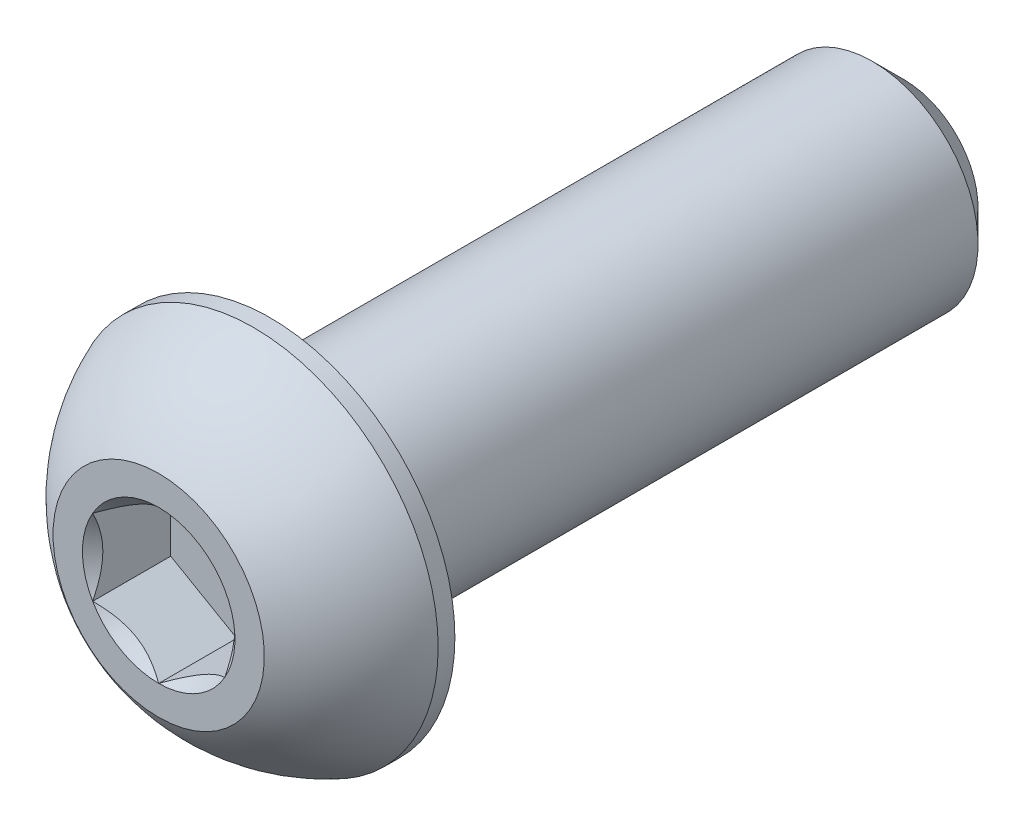
ISO-10303-21;
HEADER;
FILE_DESCRIPTION(('STEP AP214'),'2;1');
FILE_NAME('part.step','',(''),(''),'','','');
FILE_SCHEMA(('AUTOMOTIVE_DESIGN { 1 0 10303 214 1 1 1 1 }'));
ENDSEC;
DATA;
#1=APPLICATION_CONTEXT('core data for automotive mechanical design processes');
#2=APPLICATION_PROTOCOL_DEFINITION('international standard','automotive_design',2000,#1);
#3=PRODUCT_CONTEXT('',#1,'mechanical');
#4=PRODUCT('Part','Part','',(#3));
#5=PRODUCT_RELATED_PRODUCT_CATEGORY('part','',(#4));
#6=PRODUCT_DEFINITION_FORMATION('','',#4);
#7=PRODUCT_DEFINITION_CONTEXT('part definition',#1,'design');
#8=PRODUCT_DEFINITION('design','',#6,#7);
#9=PRODUCT_DEFINITION_SHAPE('','',#8);
#10=(LENGTH_UNIT() NAMED_UNIT(*) SI_UNIT(.MILLI.,.METRE.));
#11=(NAMED_UNIT(*) PLANE_ANGLE_UNIT() SI_UNIT($,.RADIAN.));
#12=(NAMED_UNIT(*) SI_UNIT($,.STERADIAN.) SOLID_ANGLE_UNIT());
#13=UNCERTAINTY_MEASURE_WITH_UNIT(LENGTH_MEASURE(1.E-05),#10,'distance_accuracy_value','');
#14=(GEOMETRIC_REPRESENTATION_CONTEXT(3) GLOBAL_UNCERTAINTY_ASSIGNED_CONTEXT((#13)) GLOBAL_UNIT_ASSIGNED_CONTEXT((#10,
#11,#12)) REPRESENTATION_CONTEXT('',''));
#15=CARTESIAN_POINT('',(0.,0.,0.));
#16=DIRECTION('',(0.,0.,1.));
#17=DIRECTION('',(1.,0.,0.));
#18=AXIS2_PLACEMENT_3D('',#15,#16,#17);
#19=CARTESIAN_POINT('',(0.,-3.175,-22.4028));
#20=DIRECTION('',(0.,0.,-1.));
#21=DIRECTION('',(0.,1.,0.));
#22=AXIS2_PLACEMENT_3D('',#19,#20,#21);
#23=PLANE('',#22);
#24=CARTESIAN_POINT('',(0.,0.,-22.4028));
#25=DIRECTION('',(0.,0.,-1.));
#26=DIRECTION('',(0.,1.,0.));
#27=AXIS2_PLACEMENT_3D('',#24,#25,#26);
#28=CIRCLE('',#27,2.22250000000001);
#29=CARTESIAN_POINT('',(0.,2.22250000000001,-22.4028));
#30=VERTEX_POINT('',#29);
#31=EDGE_CURVE('E178',#30,#30,#28,.T.);
#32=ORIENTED_EDGE('',*,*,#31,.T.);
#33=EDGE_LOOP('',(#32));
#34=FACE_BOUND('',#33,.T.);
#35=ADVANCED_FACE('F38',(#34),#23,.T.);
#36=CARTESIAN_POINT('',(0.,0.,-22.4028));
#37=DIRECTION('',(0.,0.,-1.));
#38=DIRECTION('',(0.,1.,0.));
#39=AXIS2_PLACEMENT_3D('',#36,#37,#38);
#40=CYLINDRICAL_SURFACE('',#39,3.175);
#41=CARTESIAN_POINT('',(0.,0.,-21.4503));
#42=DIRECTION('',(0.,0.,-1.));
#43=DIRECTION('',(0.,1.,0.));
#44=AXIS2_PLACEMENT_3D('',#41,#42,#43);
#45=CIRCLE('',#44,3.175);
#46=CARTESIAN_POINT('',(0.,3.175,-21.4503));
#47=VERTEX_POINT('',#46);
#48=EDGE_CURVE('E52',#47,#47,#45,.F.);
#49=ORIENTED_EDGE('',*,*,#48,.T.);
#50=EDGE_LOOP('',(#49));
#51=FACE_BOUND('',#50,.T.);
#52=CARTESIAN_POINT('',(0.,0.,-3.3528));
#53=DIRECTION('',(0.,0.,1.));
#54=DIRECTION('',(1.,0.,0.));
#55=AXIS2_PLACEMENT_3D('',#52,#53,#54);
#56=CIRCLE('',#55,3.175);
#57=CARTESIAN_POINT('',(3.175,0.,-3.3528));
#58=VERTEX_POINT('',#57);
#59=EDGE_CURVE('E175',#58,#58,#56,.F.);
#60=ORIENTED_EDGE('',*,*,#59,.T.);
#61=EDGE_LOOP('',(#60));
#62=FACE_BOUND('',#61,.T.);
#63=ADVANCED_FACE('F183',(#51,#62),#40,.T.);
#64=CARTESIAN_POINT('',(0.,0.,-22.4028));
#65=DIRECTION('',(0.,0.,1.));
#66=DIRECTION('',(0.,-1.,0.));
#67=AXIS2_PLACEMENT_3D('',#64,#65,#66);
#68=CONICAL_SURFACE('',#67,2.22250000000001,0.785398163397448);
#69=ORIENTED_EDGE('',*,*,#48,.F.);
#70=EDGE_LOOP('',(#69));
#71=FACE_BOUND('',#70,.T.);
#72=ORIENTED_EDGE('',*,*,#31,.F.);
#73=EDGE_LOOP('',(#72));
#74=FACE_BOUND('',#73,.T.);
#75=ADVANCED_FACE('F40',(#71,#74),#68,.T.);
#76=CARTESIAN_POINT('',(0.,0.,-5.060315));
#77=DIRECTION('',(0.,0.,1.));
#78=DIRECTION('',(0.,-1.,0.));
#79=AXIS2_PLACEMENT_3D('',#76,#77,#78);
#80=SPHERICAL_SURFACE('',#79,5.97389428256184);
#81=CARTESIAN_POINT('',(0.,0.,0.));
#82=DIRECTION('',(0.,0.,1.));
#83=DIRECTION('',(1.,0.,0.));
#84=AXIS2_PLACEMENT_3D('',#81,#82,#83);
#85=CIRCLE('',#84,3.175);
#86=CARTESIAN_POINT('',(0.,-3.175,0.));
#87=VERTEX_POINT('',#86);
#88=EDGE_CURVE('E172',#87,#87,#85,.T.);
#89=CARTESIAN_POINT('',(0.,0.,-2.84988));
#90=DIRECTION('',(0.,0.,1.));
#91=DIRECTION('',(1.,0.,0.));
#92=AXIS2_PLACEMENT_3D('',#89,#90,#91);
#93=CIRCLE('',#92,5.5499);
#94=CARTESIAN_POINT('',(0.,-5.5499,-2.84988));
#95=VERTEX_POINT('',#94);
#96=EDGE_CURVE('E166',#95,#95,#93,.T.);
#97=CARTESIAN_POINT('',(0.,-3.175,0.));
#98=CARTESIAN_POINT('',(0.,-3.20828343957184,-0.0208830076580502));
#99=CARTESIAN_POINT('',(0.,-3.24136078860705,-0.0420944789280503));
#100=CARTESIAN_POINT('',(0.,-3.30709055775141,-0.0851658910984718));
#101=CARTESIAN_POINT('',(0.,-3.33974297786056,-0.107025831998893));
#102=CARTESIAN_POINT('',(0.,-3.40461014130008,-0.151385725836676));
#103=CARTESIAN_POINT('',(0.,-3.43682488463043,-0.173885678774039));
#104=CARTESIAN_POINT('',(0.,-3.50080416139461,-0.219516822259479));
#105=CARTESIAN_POINT('',(0.,-3.53256869482844,-0.242648012807557));
#106=CARTESIAN_POINT('',(0.,-3.59563518208834,-0.289532629449102));
#107=CARTESIAN_POINT('',(0.,-3.62693713591442,-0.313286055542569));
#108=CARTESIAN_POINT('',(0.,-3.68906627753106,-0.36140589409133));
#109=CARTESIAN_POINT('',(0.,-3.71989346532163,-0.385772306546626));
#110=CARTESIAN_POINT('',(0.,-3.78106107243204,-0.435108631276877));
#111=CARTESIAN_POINT('',(0.,-3.8114014917519,-0.460078543551833));
#112=CARTESIAN_POINT('',(0.,-3.87158374923259,-0.510612146063938));
#113=CARTESIAN_POINT('',(0.,-3.90142558739343,-0.536175836301086));
#114=CARTESIAN_POINT('',(0.,-3.96059906392414,-0.587887041792083));
#115=CARTESIAN_POINT('',(0.,-3.989930702294,-0.614034557045931));
#116=CARTESIAN_POINT('',(0.,-4.04807235926832,-0.666903232293407));
#117=CARTESIAN_POINT('',(0.,-4.07688237787279,-0.693624392287034));
#118=CARTESIAN_POINT('',(0.,-4.13396957842491,-0.747629953401057));
#119=CARTESIAN_POINT('',(0.,-4.16224676037257,-0.774914354521453));
#120=CARTESIAN_POINT('',(0.,-4.21825727817542,-0.830035774981947));
#121=CARTESIAN_POINT('',(0.,-4.24599061403061,-0.857872794322045));
#122=CARTESIAN_POINT('',(0.,-4.30090264195357,-0.91408861315902));
#123=CARTESIAN_POINT('',(0.,-4.32808133402134,-0.942467412655899));
#124=CARTESIAN_POINT('',(0.,-4.38187349261953,-0.999755742806741));
#125=CARTESIAN_POINT('',(0.,-4.40848695914995,-1.0286652734607));
#126=CARTESIAN_POINT('',(0.,-4.46113830498838,-1.08700381029123));
#127=CARTESIAN_POINT('',(0.,-4.48717618429639,-1.11643281646778));
#128=CARTESIAN_POINT('',(0.,-4.53866621810402,-1.17579884645643));
#129=CARTESIAN_POINT('',(0.,-4.56411837260364,-1.20573587026853));
#130=CARTESIAN_POINT('',(0.,-4.61442704725457,-1.26610627984964));
#131=CARTESIAN_POINT('',(0.,-4.63928356740587,-1.29653966561866));
#132=CARTESIAN_POINT('',(0.,-4.68839129572448,-1.3578909501815));
#133=CARTESIAN_POINT('',(0.,-4.71264250389178,-1.38880884897531));
#134=CARTESIAN_POINT('',(0.,-4.76053016627881,-1.45111712201534));
#135=CARTESIAN_POINT('',(0.,-4.78416662049853,-1.48250749626155));
#136=CARTESIAN_POINT('',(0.,-4.8308155723751,-1.54574849868041));
#137=CARTESIAN_POINT('',(0.,-4.85382807003194,-1.57759912685306));
#138=CARTESIAN_POINT('',(0.,-4.89922014909859,-1.64174823640362));
#139=CARTESIAN_POINT('',(0.,-4.92159973050841,-1.67404671778154));
#140=CARTESIAN_POINT('',(0.,-4.96571726381658,-1.73907895865427));
#141=CARTESIAN_POINT('',(0.,-4.98745521571493,-1.77181271814908));
#142=CARTESIAN_POINT('',(0.,-5.03028102654719,-1.83770277069632));
#143=CARTESIAN_POINT('',(0.,-5.0513688854811,-1.87085906374874));
#144=CARTESIAN_POINT('',(0.,-5.09288630004063,-1.93758127434189));
#145=CARTESIAN_POINT('',(0.,-5.11331585566624,-1.97114719188261));
#146=CARTESIAN_POINT('',(0.,-5.15350870956168,-2.03867558290299));
#147=CARTESIAN_POINT('',(0.,-5.17327200783151,-2.07263805638265));
#148=CARTESIAN_POINT('',(0.,-5.21212465239608,-2.14094633632486));
#149=CARTESIAN_POINT('',(0.,-5.23121399869082,-2.17529214278741));
#150=CARTESIAN_POINT('',(0.,-5.26871130697935,-2.2443537165359));
#151=CARTESIAN_POINT('',(0.,-5.28711926897315,-2.27906948382184));
#152=CARTESIAN_POINT('',(0.,-5.32324664200827,-2.3488574628552));
#153=CARTESIAN_POINT('',(0.,-5.3409660530496,-2.38392967460262));
#154=CARTESIAN_POINT('',(0.,-5.37570942417474,-2.45441688802313));
#155=CARTESIAN_POINT('',(0.,-5.39273338425856,-2.48983188969622));
#156=CARTESIAN_POINT('',(0.,-5.42607922958184,-2.56099089271574));
#157=CARTESIAN_POINT('',(0.,-5.44240111482132,-2.59673489406217));
#158=CARTESIAN_POINT('',(0.,-5.47433643994316,-2.66853798649801));
#159=CARTESIAN_POINT('',(0.,-5.48994987982553,-2.70459707758742));
#160=CARTESIAN_POINT('',(0.,-5.52046229408188,-2.77701628549785));
#161=CARTESIAN_POINT('',(0.,-5.53536126845586,-2.81337640231887));
#162=CARTESIAN_POINT('',(0.,-5.5499,-2.84988));
#163=B_SPLINE_CURVE_WITH_KNOTS('',3,(#97,#98,#99,#100,#101,#102,#103,#104,#105,#106,#107,#108,
#109,#110,#111,#112,#113,#114,#115,#116,#117,#118,#119,#120,#121,#122,#123,#124,#125,#126,#127,
#128,#129,#130,#131,#132,#133,#134,#135,#136,#137,#138,#139,#140,#141,#142,#143,#144,#145,#146,
#147,#148,#149,#150,#151,#152,#153,#154,#155,#156,#157,#158,#159,#160,#161,#162),.UNSPECIFIED.,
.F.,.F.,(4,2,2,2,2,2,2,2,2,2,2,2,2,2,2,2,2,2,2,2,2,2,2,2,2,2,2,2,2,2,2,2,4),(0.,0.1178750807537,
0.235750161507399,0.353625242261099,0.471500323014798,0.589375403768498,0.707250484522198,
0.825125565275897,0.943000646029597,1.0608757267833,1.17875080753699,1.2966258882907,
1.41450096904439,1.53237604979809,1.65025113055179,1.76812621130549,1.88600129205919,
2.00387637281289,2.12175145356659,2.23962653432029,2.35750161507399,2.47537669582769,
2.59325177658139,2.71112685733509,2.82900193808879,2.94687701884249,3.06475209959619,
3.18262718034989,3.30050226110359,3.41837734185729,3.53625242261099,3.65412750336469,
3.77200258411839),.UNSPECIFIED.);
#164=EDGE_CURVE('BSEAM188',#87,#95,#163,.T.);
#165=ORIENTED_EDGE('',*,*,#88,.F.);
#166=ORIENTED_EDGE('',*,*,#96,.T.);
#167=ORIENTED_EDGE('',*,*,#164,.T.);
#168=ORIENTED_EDGE('',*,*,#164,.F.);
#169=EDGE_LOOP('',(#165,#167,#166,#168));
#170=FACE_BOUND('',#169,.T.);
#171=ADVANCED_FACE('F188',(#170),#80,.T.);
#172=CARTESIAN_POINT('',(0.,-3.175,0.));
#173=DIRECTION('',(0.,0.,-1.));
#174=DIRECTION('',(-1.,0.,0.));
#175=AXIS2_PLACEMENT_3D('',#172,#173,#174);
#176=PLANE('',#175);
#177=CARTESIAN_POINT('',(0.,0.,0.));
#178=DIRECTION('',(0.,0.,1.));
#179=DIRECTION('',(1.,0.,0.));
#180=AXIS2_PLACEMENT_3D('',#177,#178,#179);
#181=CIRCLE('',#180,2.29135888084633);
#182=CARTESIAN_POINT('',(-1.984375,1.14567944042316,0.));
#183=VERTEX_POINT('',#182);
#184=CARTESIAN_POINT('',(-1.984375,-1.14567944042316,0.));
#185=VERTEX_POINT('',#184);
#186=EDGE_CURVE('E65',#183,#185,#181,.T.);
#187=ORIENTED_EDGE('',*,*,#186,.F.);
#188=CARTESIAN_POINT('',(0.,2.29135888084633,0.));
#189=VERTEX_POINT('',#188);
#190=EDGE_CURVE('E137',#189,#183,#181,.T.);
#191=ORIENTED_EDGE('',*,*,#190,.F.);
#192=CARTESIAN_POINT('',(1.984375,1.14567944042316,0.));
#193=VERTEX_POINT('',#192);
#194=EDGE_CURVE('E134',#193,#189,#181,.T.);
#195=ORIENTED_EDGE('',*,*,#194,.F.);
#196=CARTESIAN_POINT('',(1.984375,-1.14567944042316,0.));
#197=VERTEX_POINT('',#196);
#198=EDGE_CURVE('E105',#197,#193,#181,.T.);
#199=ORIENTED_EDGE('',*,*,#198,.F.);
#200=CARTESIAN_POINT('',(0.,-2.29135888084633,0.));
#201=VERTEX_POINT('',#200);
#202=EDGE_CURVE('E97',#201,#197,#181,.T.);
#203=ORIENTED_EDGE('',*,*,#202,.F.);
#204=EDGE_CURVE('E58',#185,#201,#181,.T.);
#205=ORIENTED_EDGE('',*,*,#204,.F.);
#206=EDGE_LOOP('',(#187,#191,#195,#199,#203,#205));
#207=FACE_BOUND('',#206,.T.);
#208=ORIENTED_EDGE('',*,*,#88,.T.);
#209=EDGE_LOOP('',(#208));
#210=FACE_BOUND('',#209,.T.);
#211=ADVANCED_FACE('F131',(#207,#210),#176,.F.);
#212=CARTESIAN_POINT('',(0.,-5.5499,-3.3528));
#213=DIRECTION('',(0.,0.,1.));
#214=DIRECTION('',(1.,0.,0.));
#215=AXIS2_PLACEMENT_3D('',#212,#213,#214);
#216=PLANE('',#215);
#217=ORIENTED_EDGE('',*,*,#59,.F.);
#218=EDGE_LOOP('',(#217));
#219=FACE_BOUND('',#218,.T.);
#220=CARTESIAN_POINT('',(0.,0.,-3.3528));
#221=DIRECTION('',(0.,0.,1.));
#222=DIRECTION('',(1.,0.,0.));
#223=AXIS2_PLACEMENT_3D('',#220,#221,#222);
#224=CIRCLE('',#223,5.5499);
#225=CARTESIAN_POINT('',(5.5499,0.,-3.3528));
#226=VERTEX_POINT('',#225);
#227=EDGE_CURVE('E169',#226,#226,#224,.T.);
#228=ORIENTED_EDGE('',*,*,#227,.F.);
#229=EDGE_LOOP('',(#228));
#230=FACE_BOUND('',#229,.T.);
#231=ADVANCED_FACE('F202',(#219,#230),#216,.F.);
#232=CARTESIAN_POINT('',(0.,0.,0.));
#233=DIRECTION('',(0.,0.,1.));
#234=DIRECTION('',(1.,0.,0.));
#235=AXIS2_PLACEMENT_3D('',#232,#233,#234);
#236=CYLINDRICAL_SURFACE('',#235,5.5499);
#237=ORIENTED_EDGE('',*,*,#96,.F.);
#238=EDGE_LOOP('',(#237));
#239=FACE_BOUND('',#238,.T.);
#240=ORIENTED_EDGE('',*,*,#227,.T.);
#241=EDGE_LOOP('',(#240));
#242=FACE_BOUND('',#241,.T.);
#243=ADVANCED_FACE('F205',(#239,#242),#236,.T.);
#244=CARTESIAN_POINT('',(0.,0.,0.));
#245=DIRECTION('',(0.,0.,1.));
#246=DIRECTION('',(1.,0.,0.));
#247=AXIS2_PLACEMENT_3D('',#244,#245,#246);
#248=CONICAL_SURFACE('',#247,2.29135888084633,0.78539816339745);
#249=ORIENTED_EDGE('',*,*,#198,.T.);
#250=CARTESIAN_POINT('',(1.984375,-2.28495242157822,0.734984078816568));
#251=CARTESIAN_POINT('',(1.984375,-2.22931635455402,0.692986685550762));
#252=CARTESIAN_POINT('',(1.984375,-2.17336876548389,0.651396054076336));
#253=CARTESIAN_POINT('',(1.984375,-2.06072770258171,0.569208461471479));
#254=CARTESIAN_POINT('',(1.984375,-2.00403404503435,0.528611752405042));
#255=CARTESIAN_POINT('',(1.984375,-1.88936329173488,0.448303503174668));
#256=CARTESIAN_POINT('',(1.984375,-1.83137965519348,0.408601258813307));
#257=CARTESIAN_POINT('',(1.984375,-1.7144280213784,0.330685173401292));
#258=CARTESIAN_POINT('',(1.984375,-1.65546009407228,0.292471227194368));
#259=CARTESIAN_POINT('',(1.984375,-1.47005472306035,0.176252834013637));
#260=CARTESIAN_POINT('',(1.984375,-1.34163909427883,0.101347886872381));
#261=CARTESIAN_POINT('',(1.984375,-1.0784038470548,-0.0356697845602627));
#262=CARTESIAN_POINT('',(1.984375,-0.943607781407424,-0.0978256335176254));
#263=CARTESIAN_POINT('',(1.984375,-0.741275100444881,-0.173867421311381));
#264=CARTESIAN_POINT('',(1.984375,-0.676735408881095,-0.195691938673995));
#265=CARTESIAN_POINT('',(1.984375,-0.546098118112761,-0.234159536462205));
#266=CARTESIAN_POINT('',(1.984375,-0.480000411919955,-0.250802259934452));
#267=CARTESIAN_POINT('',(1.984375,-0.347746170028531,-0.277764619130277));
#268=CARTESIAN_POINT('',(1.984375,-0.281612071479122,-0.288192590264109));
#269=CARTESIAN_POINT('',(1.984375,-0.14863662005235,-0.302521852623404));
#270=CARTESIAN_POINT('',(1.984375,-0.0817953907393235,-0.306424265772614));
#271=CARTESIAN_POINT('',(1.984375,0.0495156750890644,-0.307412948667327));
#272=CARTESIAN_POINT('',(1.984375,0.113983775102991,-0.304740821124985));
#273=CARTESIAN_POINT('',(1.984375,0.242367515846177,-0.293260789502485));
#274=CARTESIAN_POINT('',(1.984375,0.30628310229592,-0.284452289360786));
#275=CARTESIAN_POINT('',(1.984375,0.434181040262184,-0.261030978667103));
#276=CARTESIAN_POINT('',(1.984375,0.498145026858309,-0.246319393767914));
#277=CARTESIAN_POINT('',(1.984375,0.624675616953007,-0.211873818587874));
#278=CARTESIAN_POINT('',(1.984375,0.687242336899689,-0.192140248550805));
#279=CARTESIAN_POINT('',(1.984375,0.884225483826088,-0.12258776276924));
#280=CARTESIAN_POINT('',(1.984375,1.01583674256468,-0.0648475887435034));
#281=CARTESIAN_POINT('',(1.984375,1.27288659242652,0.063530336588798));
#282=CARTESIAN_POINT('',(1.984375,1.3983008827048,0.134214424919413));
#283=CARTESIAN_POINT('',(1.984375,1.57956687990221,0.244516663813199));
#284=CARTESIAN_POINT('',(1.984375,1.63738271299424,0.280969829475364));
#285=CARTESIAN_POINT('',(1.984375,1.75202215386202,0.355415963291705));
#286=CARTESIAN_POINT('',(1.984375,1.80884568601362,0.393409048078054));
#287=CARTESIAN_POINT('',(1.984375,1.92116923084255,0.470338808893091));
#288=CARTESIAN_POINT('',(1.984375,1.97667624512253,0.509265313038791));
#289=CARTESIAN_POINT('',(1.984375,2.08693170717166,0.588147746121386));
#290=CARTESIAN_POINT('',(1.984375,2.14168035934793,0.62810338902403));
#291=CARTESIAN_POINT('',(1.984375,2.19611149046622,0.668480611285427));
#292=B_SPLINE_CURVE_WITH_KNOTS('',3,(#250,#251,#252,#253,#254,#255,#256,#257,#258,#259,#260,
#261,#262,#263,#264,#265,#266,#267,#268,#269,#270,#271,#272,#273,#274,#275,#276,#277,#278,#279,
#280,#281,#282,#283,#284,#285,#286,#287,#288,#289,#290,#291),.UNSPECIFIED.,.F.,.F.,(4,2,2,2,2,2,
2,2,2,2,2,2,2,2,2,2,2,2,2,2,4),(0.,0.209126070008322,0.418304637356569,0.629103979977992,
0.839888401371185,1.28549951116127,1.72957750768351,1.93379389749971,2.13802435186698,
2.33858179514334,2.53910475350639,2.73236963400794,2.92565329006887,3.12231577097487,
3.31896180041345,3.74886295245172,4.18033428125362,4.3853601718029,4.59040161996383,
4.79377749165108,4.99709743524131),.UNSPECIFIED.);
#293=EDGE_CURVE('E11',#197,#193,#292,.T.);
#294=ORIENTED_EDGE('',*,*,#293,.F.);
#295=EDGE_LOOP('',(#249,#294));
#296=FACE_BOUND('',#295,.T.);
#297=ADVANCED_FACE('F109',(#296),#248,.F.);
#298=ORIENTED_EDGE('',*,*,#194,.T.);
#299=CARTESIAN_POINT('',(1.984575,1.14556397036933,0.000115478781843379));
#300=CARTESIAN_POINT('',(1.9163590048332,1.18494849354192,-0.0392371477360855));
#301=CARTESIAN_POINT('',(1.84700231489303,1.22499159714897,-0.0762786895538155));
#302=CARTESIAN_POINT('',(1.70557619954781,1.30664400291398,-0.144101141576677));
#303=CARTESIAN_POINT('',(1.63349332126322,1.34826107209555,-0.174844310908246));
#304=CARTESIAN_POINT('',(1.488141602734,1.43217992591557,-0.227508111188786));
#305=CARTESIAN_POINT('',(1.41490978751306,1.47446033414663,-0.249561124120036));
#306=CARTESIAN_POINT('',(1.26683381740529,1.55995203534886,-0.283538507056124));
#307=CARTESIAN_POINT('',(1.19199418724658,1.60316071596705,-0.295488243908271));
#308=CARTESIAN_POINT('',(1.06301458545618,1.6776271237807,-0.306269900918094));
#309=CARTESIAN_POINT('',(1.00904128422756,1.7087886237741,-0.30786610094093));
#310=CARTESIAN_POINT('',(0.901182881480199,1.77106070163465,-0.305178161134708));
#311=CARTESIAN_POINT('',(0.847297817514476,1.80217125782056,-0.300891959659541));
#312=CARTESIAN_POINT('',(0.740036461751395,1.86409863044402,-0.286683126986481));
#313=CARTESIAN_POINT('',(0.686660807239859,1.89491507894443,-0.276754189547727));
#314=CARTESIAN_POINT('',(0.580832482591103,1.95601509066828,-0.251804915725461));
#315=CARTESIAN_POINT('',(0.528379742028898,1.9862986945516,-0.236784969610512));
#316=CARTESIAN_POINT('',(0.394017661036351,2.06387267818152,-0.19219214836433));
#317=CARTESIAN_POINT('',(0.312941642841675,2.11068193911104,-0.159257004061667));
#318=CARTESIAN_POINT('',(0.19372669327016,2.17951072233758,-0.103657558797803));
#319=CARTESIAN_POINT('',(0.154440075613998,2.20219286161692,-0.0841224079481375));
#320=CARTESIAN_POINT('',(0.0765946381319467,2.24713694590237,-0.0432712618805984));
#321=CARTESIAN_POINT('',(0.0380353888983008,2.26939913882716,-0.0219563604316496));
#322=CARTESIAN_POINT('',(-0.00020000000000058,2.29147435090017,0.000115478781842942));
#323=B_SPLINE_CURVE_WITH_KNOTS('',3,(#299,#300,#301,#302,#303,#304,#305,#306,#307,#308,#309,
#310,#311,#312,#313,#314,#315,#316,#317,#318,#319,#320,#321,#322),.UNSPECIFIED.,.F.,.F.,(4,2,2,
2,2,2,2,2,2,2,2,4),(0.,0.264339630306627,0.530219665093694,0.79187641637146,1.05287424418109,
1.239639843932,1.42647091743852,1.61351120244035,1.8005371524754,2.09764209964316,
2.24579179873714,2.39385111134157),.UNSPECIFIED.);
#324=EDGE_CURVE('E136',#193,#189,#323,.T.);
#325=ORIENTED_EDGE('',*,*,#324,.F.);
#326=EDGE_LOOP('',(#298,#325));
#327=FACE_BOUND('',#326,.T.);
#328=ADVANCED_FACE('F290',(#327),#248,.F.);
#329=ORIENTED_EDGE('',*,*,#190,.T.);
#330=CARTESIAN_POINT('',(0.000199999999999608,2.29147435090017,0.000115478781843248));
#331=CARTESIAN_POINT('',(-0.0680159951668025,2.25208982772757,-0.0392371477360854));
#332=CARTESIAN_POINT('',(-0.137372685106966,2.21204672412052,-0.0762786895538155));
#333=CARTESIAN_POINT('',(-0.278798800452188,2.13039431835551,-0.144101141576677));
#334=CARTESIAN_POINT('',(-0.350881678736783,2.08877724917394,-0.174844310908246));
#335=CARTESIAN_POINT('',(-0.496233397266004,2.00485839535392,-0.227508111188786));
#336=CARTESIAN_POINT('',(-0.569465212486939,1.96257798712287,-0.249561124120036));
#337=CARTESIAN_POINT('',(-0.717541182594707,1.87708628592063,-0.283538507056124));
#338=CARTESIAN_POINT('',(-0.792380812753425,1.83387760530244,-0.295488243908272));
#339=CARTESIAN_POINT('',(-0.921360414543816,1.75941119748879,-0.306269900918094));
#340=CARTESIAN_POINT('',(-0.975333715772443,1.72824969749539,-0.307866100940931));
#341=CARTESIAN_POINT('',(-1.0831921185198,1.66597761963484,-0.305178161134708));
#342=CARTESIAN_POINT('',(-1.13707718248552,1.63486706344893,-0.300891959659541));
#343=CARTESIAN_POINT('',(-1.2443385382486,1.57293969082547,-0.286683126986481));
#344=CARTESIAN_POINT('',(-1.29771419276014,1.54212324232506,-0.276754189547727));
#345=CARTESIAN_POINT('',(-1.4035425174089,1.48102323060122,-0.251804915725462));
#346=CARTESIAN_POINT('',(-1.4559952579711,1.45073962671789,-0.236784969610512));
#347=CARTESIAN_POINT('',(-1.59035733896365,1.37316564308797,-0.19219214836433));
#348=CARTESIAN_POINT('',(-1.67143335715832,1.32635638215845,-0.159257004061668));
#349=CARTESIAN_POINT('',(-1.79064830672984,1.25752759893191,-0.103657558797804));
#350=CARTESIAN_POINT('',(-1.829934924386,1.23484545965257,-0.0841224079481378));
#351=CARTESIAN_POINT('',(-1.90778036186805,1.18990137536712,-0.0432712618805986));
#352=CARTESIAN_POINT('',(-1.9463396111017,1.16763918244233,-0.0219563604316498));
#353=CARTESIAN_POINT('',(-1.984575,1.14556397036933,0.000115478781842511));
#354=B_SPLINE_CURVE_WITH_KNOTS('',3,(#330,#331,#332,#333,#334,#335,#336,#337,#338,#339,#340,
#341,#342,#343,#344,#345,#346,#347,#348,#349,#350,#351,#352,#353),.UNSPECIFIED.,.F.,.F.,(4,2,2,
2,2,2,2,2,2,2,2,4),(0.,0.264339630306627,0.530219665093694,0.791876416371461,1.05287424418109,
1.239639843932,1.42647091743852,1.61351120244035,1.8005371524754,2.09764209964316,
2.24579179873714,2.39385111134157),.UNSPECIFIED.);
#355=EDGE_CURVE('E141',#189,#183,#354,.T.);
#356=ORIENTED_EDGE('',*,*,#355,.F.);
#357=EDGE_LOOP('',(#329,#356));
#358=FACE_BOUND('',#357,.T.);
#359=ADVANCED_FACE('F144',(#358),#248,.F.);
#360=ORIENTED_EDGE('',*,*,#186,.T.);
#361=CARTESIAN_POINT('',(-1.984375,-2.28495242157823,0.734984078816569));
#362=CARTESIAN_POINT('',(-1.984375,-2.22931635455402,0.692986685550762));
#363=CARTESIAN_POINT('',(-1.984375,-2.17336876548389,0.651396054076336));
#364=CARTESIAN_POINT('',(-1.984375,-2.06072770258171,0.56920846147148));
#365=CARTESIAN_POINT('',(-1.984375,-2.00403404503435,0.528611752405043));
#366=CARTESIAN_POINT('',(-1.984375,-1.88936329173489,0.448303503174669));
#367=CARTESIAN_POINT('',(-1.984375,-1.83137965519348,0.408601258813308));
#368=CARTESIAN_POINT('',(-1.984375,-1.7144280213784,0.330685173401292));
#369=CARTESIAN_POINT('',(-1.984375,-1.65546009407228,0.292471227194368));
#370=CARTESIAN_POINT('',(-1.984375,-1.47005472306035,0.176252834013636));
#371=CARTESIAN_POINT('',(-1.984375,-1.34163909427883,0.101347886872382));
#372=CARTESIAN_POINT('',(-1.984375,-1.0784038470548,-0.0356697845602624));
#373=CARTESIAN_POINT('',(-1.984375,-0.943607781407425,-0.0978256335176256));
#374=CARTESIAN_POINT('',(-1.984375,-0.741275100444882,-0.173867421311381));
#375=CARTESIAN_POINT('',(-1.984375,-0.676735408881095,-0.195691938673995));
#376=CARTESIAN_POINT('',(-1.984375,-0.546098118112762,-0.234159536462205));
#377=CARTESIAN_POINT('',(-1.984375,-0.480000411919956,-0.250802259934452));
#378=CARTESIAN_POINT('',(-1.984375,-0.347746170028532,-0.277764619130277));
#379=CARTESIAN_POINT('',(-1.984375,-0.281612071479123,-0.288192590264108));
#380=CARTESIAN_POINT('',(-1.984375,-0.14863662005235,-0.302521852623404));
#381=CARTESIAN_POINT('',(-1.984375,-0.0817953907393237,-0.306424265772614));
#382=CARTESIAN_POINT('',(-1.984375,0.0495156750890643,-0.307412948667328));
#383=CARTESIAN_POINT('',(-1.984375,0.113983775102991,-0.304740821124985));
#384=CARTESIAN_POINT('',(-1.984375,0.242367515846177,-0.293260789502485));
#385=CARTESIAN_POINT('',(-1.984375,0.306283102295919,-0.284452289360786));
#386=CARTESIAN_POINT('',(-1.984375,0.434181040262184,-0.261030978667103));
#387=CARTESIAN_POINT('',(-1.984375,0.498145026858309,-0.246319393767914));
#388=CARTESIAN_POINT('',(-1.984375,0.624675616953007,-0.211873818587874));
#389=CARTESIAN_POINT('',(-1.984375,0.687242336899689,-0.192140248550805));
#390=CARTESIAN_POINT('',(-1.984375,0.884225483826087,-0.12258776276924));
#391=CARTESIAN_POINT('',(-1.984375,1.01583674256468,-0.0648475887435036));
#392=CARTESIAN_POINT('',(-1.984375,1.27288659242652,0.0635303365887976));
#393=CARTESIAN_POINT('',(-1.984375,1.3983008827048,0.134214424919412));
#394=CARTESIAN_POINT('',(-1.984375,1.57956687990221,0.244516663813198));
#395=CARTESIAN_POINT('',(-1.984375,1.63738271299424,0.280969829475363));
#396=CARTESIAN_POINT('',(-1.984375,1.75202215386202,0.355415963291704));
#397=CARTESIAN_POINT('',(-1.984375,1.80884568601362,0.393409048078054));
#398=CARTESIAN_POINT('',(-1.984375,1.92116923084255,0.47033880889309));
#399=CARTESIAN_POINT('',(-1.984375,1.97667624512253,0.509265313038791));
#400=CARTESIAN_POINT('',(-1.984375,2.08693170717166,0.588147746121386));
#401=CARTESIAN_POINT('',(-1.984375,2.14168035934793,0.628103389024029));
#402=CARTESIAN_POINT('',(-1.984375,2.19611149046622,0.668480611285426));
#403=B_SPLINE_CURVE_WITH_KNOTS('',3,(#361,#362,#363,#364,#365,#366,#367,#368,#369,#370,#371,
#372,#373,#374,#375,#376,#377,#378,#379,#380,#381,#382,#383,#384,#385,#386,#387,#388,#389,#390,
#391,#392,#393,#394,#395,#396,#397,#398,#399,#400,#401,#402),.UNSPECIFIED.,.F.,.F.,(4,2,2,2,2,2,
2,2,2,2,2,2,2,2,2,2,2,2,2,2,4),(0.,0.209126070008322,0.41830463735657,0.629103979977993,
0.839888401371186,1.28549951116127,1.72957750768351,1.93379389749972,2.13802435186698,
2.33858179514334,2.53910475350639,2.73236963400794,2.92565329006887,3.12231577097488,
3.31896180041345,3.74886295245172,4.18033428125362,4.3853601718029,4.59040161996383,
4.79377749165108,4.99709743524131),.UNSPECIFIED.);
#404=EDGE_CURVE('E148',#183,#185,#403,.F.);
#405=ORIENTED_EDGE('',*,*,#404,.F.);
#406=EDGE_LOOP('',(#360,#405));
#407=FACE_BOUND('',#406,.T.);
#408=ADVANCED_FACE('F284',(#407),#248,.F.);
#409=ORIENTED_EDGE('',*,*,#204,.T.);
#410=CARTESIAN_POINT('',(-1.984575,-1.14556397036933,0.000115478781843379));
#411=CARTESIAN_POINT('',(-1.9163590048332,-1.18494849354192,-0.0392371477360847));
#412=CARTESIAN_POINT('',(-1.84700231489303,-1.22499159714897,-0.0762786895538149));
#413=CARTESIAN_POINT('',(-1.70557619954781,-1.30664400291398,-0.144101141576677));
#414=CARTESIAN_POINT('',(-1.63349332126322,-1.34826107209555,-0.174844310908247));
#415=CARTESIAN_POINT('',(-1.488141602734,-1.43217992591557,-0.227508111188786));
#416=CARTESIAN_POINT('',(-1.41490978751306,-1.47446033414663,-0.249561124120036));
#417=CARTESIAN_POINT('',(-1.26683381740529,-1.55995203534886,-0.283538507056124));
#418=CARTESIAN_POINT('',(-1.19199418724658,-1.60316071596705,-0.295488243908271));
#419=CARTESIAN_POINT('',(-1.06301458545618,-1.6776271237807,-0.306269900918094));
#420=CARTESIAN_POINT('',(-1.00904128422756,-1.7087886237741,-0.30786610094093));
#421=CARTESIAN_POINT('',(-0.9011828814802,-1.77106070163465,-0.305178161134707));
#422=CARTESIAN_POINT('',(-0.847297817514477,-1.80217125782056,-0.30089195965954));
#423=CARTESIAN_POINT('',(-0.740036461751396,-1.86409863044402,-0.286683126986481));
#424=CARTESIAN_POINT('',(-0.68666080723986,-1.89491507894443,-0.276754189547727));
#425=CARTESIAN_POINT('',(-0.580832482591103,-1.95601509066828,-0.251804915725461));
#426=CARTESIAN_POINT('',(-0.528379742028898,-1.9862986945516,-0.236784969610511));
#427=CARTESIAN_POINT('',(-0.394017661036351,-2.06387267818152,-0.19219214836433));
#428=CARTESIAN_POINT('',(-0.312941642841675,-2.11068193911104,-0.159257004061667));
#429=CARTESIAN_POINT('',(-0.19372669327016,-2.17951072233758,-0.103657558797803));
#430=CARTESIAN_POINT('',(-0.154440075613998,-2.20219286161692,-0.0841224079481371));
#431=CARTESIAN_POINT('',(-0.0765946381319465,-2.24713694590237,-0.0432712618805977));
#432=CARTESIAN_POINT('',(-0.0380353888983009,-2.26939913882716,-0.0219563604316487));
#433=CARTESIAN_POINT('',(0.000200000000000425,-2.29147435090017,0.000115478781843735));
#434=B_SPLINE_CURVE_WITH_KNOTS('',3,(#410,#411,#412,#413,#414,#415,#416,#417,#418,#419,#420,
#421,#422,#423,#424,#425,#426,#427,#428,#429,#430,#431,#432,#433),.UNSPECIFIED.,.F.,.F.,(4,2,2,
2,2,2,2,2,2,2,2,4),(0.,0.264339630306627,0.530219665093694,0.79187641637146,1.05287424418109,
1.239639843932,1.42647091743852,1.61351120244035,1.8005371524754,2.09764209964316,
2.24579179873714,2.39385111134157),.UNSPECIFIED.);
#435=EDGE_CURVE('E121',#185,#201,#434,.T.);
#436=ORIENTED_EDGE('',*,*,#435,.F.);
#437=EDGE_LOOP('',(#409,#436));
#438=FACE_BOUND('',#437,.T.);
#439=ADVANCED_FACE('F232',(#438),#248,.F.);
#440=ORIENTED_EDGE('',*,*,#202,.T.);
#441=CARTESIAN_POINT('',(-0.000199999999999594,-2.29147435090017,0.000115478781843681));
#442=CARTESIAN_POINT('',(0.0680159951668032,-2.25208982772757,-0.0392371477360843));
#443=CARTESIAN_POINT('',(0.137372685106967,-2.21204672412052,-0.0762786895538144));
#444=CARTESIAN_POINT('',(0.278798800452188,-2.13039431835551,-0.144101141576676));
#445=CARTESIAN_POINT('',(0.350881678736783,-2.08877724917394,-0.174844310908246));
#446=CARTESIAN_POINT('',(0.496233397266004,-2.00485839535392,-0.227508111188787));
#447=CARTESIAN_POINT('',(0.569465212486939,-1.96257798712287,-0.249561124120036));
#448=CARTESIAN_POINT('',(0.717541182594707,-1.87708628592063,-0.283538507056124));
#449=CARTESIAN_POINT('',(0.792380812753425,-1.83387760530244,-0.295488243908272));
#450=CARTESIAN_POINT('',(0.921360414543816,-1.75941119748879,-0.306269900918094));
#451=CARTESIAN_POINT('',(0.975333715772443,-1.72824969749539,-0.30786610094093));
#452=CARTESIAN_POINT('',(1.0831921185198,-1.66597761963484,-0.305178161134708));
#453=CARTESIAN_POINT('',(1.13707718248552,-1.63486706344893,-0.300891959659541));
#454=CARTESIAN_POINT('',(1.2443385382486,-1.57293969082547,-0.286683126986481));
#455=CARTESIAN_POINT('',(1.29771419276014,-1.54212324232506,-0.276754189547727));
#456=CARTESIAN_POINT('',(1.4035425174089,-1.48102323060122,-0.251804915725462));
#457=CARTESIAN_POINT('',(1.4559952579711,-1.45073962671789,-0.236784969610512));
#458=CARTESIAN_POINT('',(1.59035733896365,-1.37316564308797,-0.19219214836433));
#459=CARTESIAN_POINT('',(1.67143335715832,-1.32635638215845,-0.159257004061668));
#460=CARTESIAN_POINT('',(1.79064830672984,-1.25752759893191,-0.103657558797804));
#461=CARTESIAN_POINT('',(1.829934924386,-1.23484545965257,-0.0841224079481379));
#462=CARTESIAN_POINT('',(1.90778036186805,-1.18990137536712,-0.0432712618805987));
#463=CARTESIAN_POINT('',(1.9463396111017,-1.16763918244233,-0.0219563604316498));
#464=CARTESIAN_POINT('',(1.984575,-1.14556397036933,0.000115478781842673));
#465=B_SPLINE_CURVE_WITH_KNOTS('',3,(#441,#442,#443,#444,#445,#446,#447,#448,#449,#450,#451,
#452,#453,#454,#455,#456,#457,#458,#459,#460,#461,#462,#463,#464),.UNSPECIFIED.,.F.,.F.,(4,2,2,
2,2,2,2,2,2,2,2,4),(0.,0.264339630306627,0.530219665093695,0.791876416371461,1.05287424418109,
1.239639843932,1.42647091743852,1.61351120244035,1.8005371524754,2.09764209964316,
2.24579179873714,2.39385111134157),.UNSPECIFIED.);
#466=EDGE_CURVE('E101',#201,#197,#465,.T.);
#467=ORIENTED_EDGE('',*,*,#466,.F.);
#468=EDGE_LOOP('',(#440,#467));
#469=FACE_BOUND('',#468,.T.);
#470=ADVANCED_FACE('F99',(#469),#248,.F.);
#471=CARTESIAN_POINT('',(1.984375,-1.14567944042316,-2.34696));
#472=DIRECTION('',(0.,0.,1.));
#473=DIRECTION('',(1.,0.,0.));
#474=AXIS2_PLACEMENT_3D('',#471,#472,#473);
#475=PLANE('',#474);
#476=DIRECTION('',(0.866025403784438,0.5,0.));
#477=VECTOR('',#476,1.);
#478=CARTESIAN_POINT('',(0.,-2.29135888084633,-2.34696));
#479=LINE('',#478,#477);
#480=CARTESIAN_POINT('',(0.,-2.29135888084633,-2.34696));
#481=VERTEX_POINT('',#480);
#482=CARTESIAN_POINT('',(1.984375,-1.14567944042316,-2.34696));
#483=VERTEX_POINT('',#482);
#484=EDGE_CURVE('E120',#481,#483,#479,.T.);
#485=ORIENTED_EDGE('',*,*,#484,.T.);
#486=DIRECTION('',(0.,1.,0.));
#487=VECTOR('',#486,1.);
#488=CARTESIAN_POINT('',(1.984375,-1.14567944042316,-2.34696));
#489=LINE('',#488,#487);
#490=CARTESIAN_POINT('',(1.984375,1.14567944042316,-2.34696));
#491=VERTEX_POINT('',#490);
#492=EDGE_CURVE('E125',#483,#491,#489,.T.);
#493=ORIENTED_EDGE('',*,*,#492,.T.);
#494=DIRECTION('',(-0.866025403784439,0.5,0.));
#495=VECTOR('',#494,1.);
#496=CARTESIAN_POINT('',(1.984375,1.14567944042316,-2.34696));
#497=LINE('',#496,#495);
#498=CARTESIAN_POINT('',(0.,2.29135888084633,-2.34696));
#499=VERTEX_POINT('',#498);
#500=EDGE_CURVE('E274',#491,#499,#497,.T.);
#501=ORIENTED_EDGE('',*,*,#500,.T.);
#502=DIRECTION('',(-0.866025403784438,-0.5,0.));
#503=VECTOR('',#502,1.);
#504=CARTESIAN_POINT('',(0.,2.29135888084633,-2.34696));
#505=LINE('',#504,#503);
#506=CARTESIAN_POINT('',(-1.984375,1.14567944042316,-2.34696));
#507=VERTEX_POINT('',#506);
#508=EDGE_CURVE('E157',#499,#507,#505,.T.);
#509=ORIENTED_EDGE('',*,*,#508,.T.);
#510=DIRECTION('',(0.,-1.,0.));
#511=VECTOR('',#510,1.);
#512=CARTESIAN_POINT('',(-1.984375,1.14567944042316,-2.34696));
#513=LINE('',#512,#511);
#514=CARTESIAN_POINT('',(-1.984375,-1.14567944042316,-2.34696));
#515=VERTEX_POINT('',#514);
#516=EDGE_CURVE('E278',#507,#515,#513,.T.);
#517=ORIENTED_EDGE('',*,*,#516,.T.);
#518=DIRECTION('',(0.866025403784439,-0.5,0.));
#519=VECTOR('',#518,1.);
#520=CARTESIAN_POINT('',(-1.984375,-1.14567944042316,-2.34696));
#521=LINE('',#520,#519);
#522=EDGE_CURVE('E128',#515,#481,#521,.T.);
#523=ORIENTED_EDGE('',*,*,#522,.T.);
#524=EDGE_LOOP('',(#485,#493,#501,#509,#517,#523));
#525=FACE_BOUND('',#524,.T.);
#526=ADVANCED_FACE('F231',(#525),#475,.T.);
#527=CARTESIAN_POINT('',(1.984375,-1.14567944042316,-2.34696));
#528=DIRECTION('',(1.,0.,0.));
#529=DIRECTION('',(0.,0.,-1.));
#530=AXIS2_PLACEMENT_3D('',#527,#528,#529);
#531=PLANE('',#530);
#532=DIRECTION('',(0.,0.,1.));
#533=VECTOR('',#532,1.);
#534=CARTESIAN_POINT('',(1.984375,-1.14567944042316,-2.34696));
#535=LINE('',#534,#533);
#536=EDGE_CURVE('E117',#483,#197,#535,.T.);
#537=ORIENTED_EDGE('',*,*,#536,.T.);
#538=ORIENTED_EDGE('',*,*,#293,.T.);
#539=DIRECTION('',(0.,0.,1.));
#540=VECTOR('',#539,1.);
#541=CARTESIAN_POINT('',(1.984375,1.14567944042316,-2.34696));
#542=LINE('',#541,#540);
#543=EDGE_CURVE('E127',#491,#193,#542,.T.);
#544=ORIENTED_EDGE('',*,*,#543,.F.);
#545=ORIENTED_EDGE('',*,*,#492,.F.);
#546=EDGE_LOOP('',(#537,#538,#544,#545));
#547=FACE_BOUND('',#546,.T.);
#548=ADVANCED_FACE('F123',(#547),#531,.F.);
#549=CARTESIAN_POINT('',(1.984375,1.14567944042316,-2.34696));
#550=DIRECTION('',(0.5,0.866025403784439,0.));
#551=DIRECTION('',(-0.866025403784439,0.5,0.));
#552=AXIS2_PLACEMENT_3D('',#549,#550,#551);
#553=PLANE('',#552);
#554=ORIENTED_EDGE('',*,*,#543,.T.);
#555=ORIENTED_EDGE('',*,*,#324,.T.);
#556=DIRECTION('',(0.,0.,1.));
#557=VECTOR('',#556,1.);
#558=CARTESIAN_POINT('',(0.,2.29135888084633,-2.34696));
#559=LINE('',#558,#557);
#560=EDGE_CURVE('E153',#499,#189,#559,.T.);
#561=ORIENTED_EDGE('',*,*,#560,.F.);
#562=ORIENTED_EDGE('',*,*,#500,.F.);
#563=EDGE_LOOP('',(#554,#555,#561,#562));
#564=FACE_BOUND('',#563,.T.);
#565=ADVANCED_FACE('F151',(#564),#553,.F.);
#566=CARTESIAN_POINT('',(0.,2.29135888084633,-2.34696));
#567=DIRECTION('',(-0.5,0.866025403784438,0.));
#568=DIRECTION('',(-0.866025403784438,-0.5,0.));
#569=AXIS2_PLACEMENT_3D('',#566,#567,#568);
#570=PLANE('',#569);
#571=ORIENTED_EDGE('',*,*,#560,.T.);
#572=ORIENTED_EDGE('',*,*,#355,.T.);
#573=DIRECTION('',(0.,0.,1.));
#574=VECTOR('',#573,1.);
#575=CARTESIAN_POINT('',(-1.984375,1.14567944042316,-2.34696));
#576=LINE('',#575,#574);
#577=EDGE_CURVE('E159',#507,#183,#576,.T.);
#578=ORIENTED_EDGE('',*,*,#577,.F.);
#579=ORIENTED_EDGE('',*,*,#508,.F.);
#580=EDGE_LOOP('',(#571,#572,#578,#579));
#581=FACE_BOUND('',#580,.T.);
#582=ADVANCED_FACE('F155',(#581),#570,.F.);
#583=CARTESIAN_POINT('',(-1.984375,1.14567944042316,-2.34696));
#584=DIRECTION('',(-1.,0.,0.));
#585=DIRECTION('',(0.,0.,1.));
#586=AXIS2_PLACEMENT_3D('',#583,#584,#585);
#587=PLANE('',#586);
#588=ORIENTED_EDGE('',*,*,#577,.T.);
#589=ORIENTED_EDGE('',*,*,#404,.T.);
#590=DIRECTION('',(0.,0.,1.));
#591=VECTOR('',#590,1.);
#592=CARTESIAN_POINT('',(-1.984375,-1.14567944042316,-2.34696));
#593=LINE('',#592,#591);
#594=EDGE_CURVE('E161',#515,#185,#593,.T.);
#595=ORIENTED_EDGE('',*,*,#594,.F.);
#596=ORIENTED_EDGE('',*,*,#516,.F.);
#597=EDGE_LOOP('',(#588,#589,#595,#596));
#598=FACE_BOUND('',#597,.T.);
#599=ADVANCED_FACE('F253',(#598),#587,.F.);
#600=CARTESIAN_POINT('',(-1.984375,-1.14567944042316,-2.34696));
#601=DIRECTION('',(-0.5,-0.866025403784439,0.));
#602=DIRECTION('',(0.866025403784439,-0.5,0.));
#603=AXIS2_PLACEMENT_3D('',#600,#601,#602);
#604=PLANE('',#603);
#605=ORIENTED_EDGE('',*,*,#594,.T.);
#606=ORIENTED_EDGE('',*,*,#435,.T.);
#607=DIRECTION('',(0.,0.,1.));
#608=VECTOR('',#607,1.);
#609=CARTESIAN_POINT('',(0.,-2.29135888084633,-2.34696));
#610=LINE('',#609,#608);
#611=EDGE_CURVE('E119',#481,#201,#610,.T.);
#612=ORIENTED_EDGE('',*,*,#611,.F.);
#613=ORIENTED_EDGE('',*,*,#522,.F.);
#614=EDGE_LOOP('',(#605,#606,#612,#613));
#615=FACE_BOUND('',#614,.T.);
#616=ADVANCED_FACE('F212',(#615),#604,.F.);
#617=CARTESIAN_POINT('',(0.,-2.29135888084633,-2.34696));
#618=DIRECTION('',(0.5,-0.866025403784438,0.));
#619=DIRECTION('',(0.866025403784438,0.5,0.));
#620=AXIS2_PLACEMENT_3D('',#617,#618,#619);
#621=PLANE('',#620);
#622=ORIENTED_EDGE('',*,*,#611,.T.);
#623=ORIENTED_EDGE('',*,*,#466,.T.);
#624=ORIENTED_EDGE('',*,*,#536,.F.);
#625=ORIENTED_EDGE('',*,*,#484,.F.);
#626=EDGE_LOOP('',(#622,#623,#624,#625));
#627=FACE_BOUND('',#626,.T.);
#628=ADVANCED_FACE('F115',(#627),#621,.F.);
#629=CLOSED_SHELL('',(#35,#63,#75,#171,#211,#231,#243,#297,#328,#359,#408,#439,#470,#526,#548,
#565,#582,#599,#616,#628));
#630=MANIFOLD_SOLID_BREP('B2',#629);
#631=ADVANCED_BREP_SHAPE_REPRESENTATION('',(#18,#630),#14);
#632=SHAPE_DEFINITION_REPRESENTATION(#9,#631);
ENDSEC;
END-ISO-10303-21;
